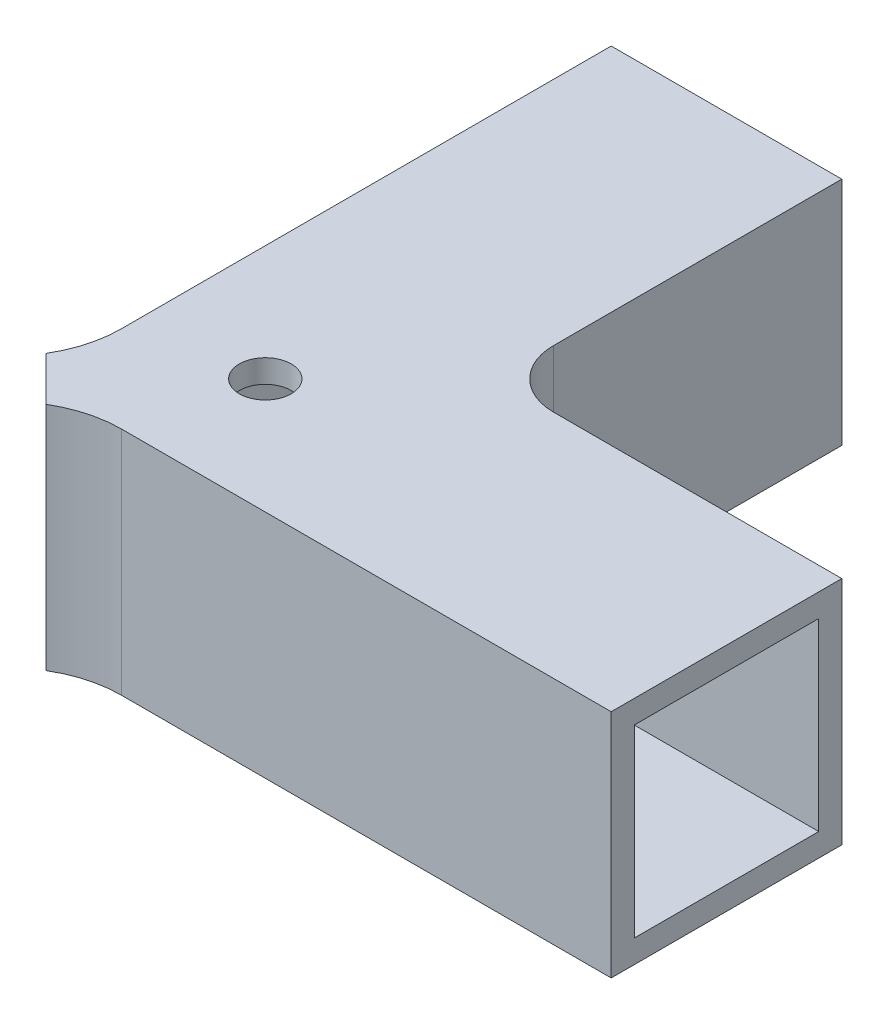
ISO-10303-21;
HEADER;
FILE_DESCRIPTION(('STEP AP214'),'2;1');
FILE_NAME('part.step','',(''),(''),'','','');
FILE_SCHEMA(('AUTOMOTIVE_DESIGN { 1 0 10303 214 1 1 1 1 }'));
ENDSEC;
DATA;
#1=APPLICATION_CONTEXT('core data for automotive mechanical design processes');
#2=APPLICATION_PROTOCOL_DEFINITION('international standard','automotive_design',2000,#1);
#3=PRODUCT_CONTEXT('',#1,'mechanical');
#4=PRODUCT('Part','Part','',(#3));
#5=PRODUCT_RELATED_PRODUCT_CATEGORY('part','',(#4));
#6=PRODUCT_DEFINITION_FORMATION('','',#4);
#7=PRODUCT_DEFINITION_CONTEXT('part definition',#1,'design');
#8=PRODUCT_DEFINITION('design','',#6,#7);
#9=PRODUCT_DEFINITION_SHAPE('','',#8);
#10=(LENGTH_UNIT() NAMED_UNIT(*) SI_UNIT(.MILLI.,.METRE.));
#11=(NAMED_UNIT(*) PLANE_ANGLE_UNIT() SI_UNIT($,.RADIAN.));
#12=(NAMED_UNIT(*) SI_UNIT($,.STERADIAN.) SOLID_ANGLE_UNIT());
#13=UNCERTAINTY_MEASURE_WITH_UNIT(LENGTH_MEASURE(1.E-05),#10,'distance_accuracy_value','');
#14=(GEOMETRIC_REPRESENTATION_CONTEXT(3) GLOBAL_UNCERTAINTY_ASSIGNED_CONTEXT((#13)) GLOBAL_UNIT_ASSIGNED_CONTEXT((#10,
#11,#12)) REPRESENTATION_CONTEXT('',''));
#15=CARTESIAN_POINT('',(0.,0.,0.));
#16=DIRECTION('',(0.,0.,1.));
#17=DIRECTION('',(1.,0.,0.));
#18=AXIS2_PLACEMENT_3D('',#15,#16,#17);
#19=CARTESIAN_POINT('',(50.,20.,50.));
#20=DIRECTION('',(0.,0.,-1.));
#21=DIRECTION('',(0.,1.,0.));
#22=AXIS2_PLACEMENT_3D('',#19,#20,#21);
#23=PLANE('',#22);
#24=DIRECTION('',(-1.,0.,0.));
#25=VECTOR('',#24,1.);
#26=CARTESIAN_POINT('',(50.,20.,50.));
#27=LINE('',#26,#25);
#28=CARTESIAN_POINT('',(50.,20.,50.));
#29=VERTEX_POINT('',#28);
#30=CARTESIAN_POINT('',(7.54103238572368,20.,50.));
#31=VERTEX_POINT('',#30);
#32=EDGE_CURVE('E248',#29,#31,#27,.T.);
#33=ORIENTED_EDGE('',*,*,#32,.T.);
#34=DIRECTION('',(0.,1.,0.));
#35=VECTOR('',#34,1.);
#36=CARTESIAN_POINT('',(7.54103238572368,20.,50.));
#37=LINE('',#36,#35);
#38=CARTESIAN_POINT('',(7.54103238572369,0.,50.));
#39=VERTEX_POINT('',#38);
#40=EDGE_CURVE('E317',#31,#39,#37,.F.);
#41=ORIENTED_EDGE('',*,*,#40,.T.);
#42=DIRECTION('',(-1.,0.,0.));
#43=VECTOR('',#42,1.);
#44=CARTESIAN_POINT('',(50.,0.,50.));
#45=LINE('',#44,#43);
#46=CARTESIAN_POINT('',(50.,0.,50.));
#47=VERTEX_POINT('',#46);
#48=EDGE_CURVE('E164',#47,#39,#45,.T.);
#49=ORIENTED_EDGE('',*,*,#48,.F.);
#50=DIRECTION('',(0.,-1.,0.));
#51=VECTOR('',#50,1.);
#52=CARTESIAN_POINT('',(50.,20.,50.));
#53=LINE('',#52,#51);
#54=EDGE_CURVE('E236',#29,#47,#53,.T.);
#55=ORIENTED_EDGE('',*,*,#54,.F.);
#56=EDGE_LOOP('',(#33,#41,#49,#55));
#57=FACE_BOUND('',#56,.T.);
#58=ADVANCED_FACE('F38',(#57),#23,.F.);
#59=CARTESIAN_POINT('',(0.,0.,30.));
#60=DIRECTION('',(1.,0.,0.));
#61=DIRECTION('',(0.,0.,-1.));
#62=AXIS2_PLACEMENT_3D('',#59,#60,#61);
#63=PLANE('',#62);
#64=DIRECTION('',(0.,0.,-1.));
#65=VECTOR('',#64,1.);
#66=CARTESIAN_POINT('',(0.,0.,30.));
#67=LINE('',#66,#65);
#68=CARTESIAN_POINT('',(0.,0.,42.4589676142763));
#69=VERTEX_POINT('',#68);
#70=CARTESIAN_POINT('',(0.,0.,0.));
#71=VERTEX_POINT('',#70);
#72=EDGE_CURVE('E310',#69,#71,#67,.T.);
#73=ORIENTED_EDGE('',*,*,#72,.F.);
#74=DIRECTION('',(0.,-1.,0.));
#75=VECTOR('',#74,1.);
#76=CARTESIAN_POINT('',(0.,0.,42.4589676142763));
#77=LINE('',#76,#75);
#78=CARTESIAN_POINT('',(0.,20.,42.4589676142763));
#79=VERTEX_POINT('',#78);
#80=EDGE_CURVE('E180',#69,#79,#77,.F.);
#81=ORIENTED_EDGE('',*,*,#80,.T.);
#82=DIRECTION('',(0.,0.,-1.));
#83=VECTOR('',#82,1.);
#84=CARTESIAN_POINT('',(0.,20.,30.));
#85=LINE('',#84,#83);
#86=CARTESIAN_POINT('',(0.,20.,0.));
#87=VERTEX_POINT('',#86);
#88=EDGE_CURVE('E301',#79,#87,#85,.T.);
#89=ORIENTED_EDGE('',*,*,#88,.T.);
#90=DIRECTION('',(0.,-1.,0.));
#91=VECTOR('',#90,1.);
#92=CARTESIAN_POINT('',(0.,0.,0.));
#93=LINE('',#92,#91);
#94=EDGE_CURVE('E285',#87,#71,#93,.T.);
#95=ORIENTED_EDGE('',*,*,#94,.T.);
#96=EDGE_LOOP('',(#73,#81,#89,#95));
#97=FACE_BOUND('',#96,.T.);
#98=ADVANCED_FACE('F374',(#97),#63,.F.);
#99=CARTESIAN_POINT('',(0.,0.,0.));
#100=DIRECTION('',(0.,0.,-1.));
#101=DIRECTION('',(-1.,0.,0.));
#102=AXIS2_PLACEMENT_3D('',#99,#100,#101);
#103=PLANE('',#102);
#104=ORIENTED_EDGE('',*,*,#94,.F.);
#105=DIRECTION('',(-1.,0.,0.));
#106=VECTOR('',#105,1.);
#107=CARTESIAN_POINT('',(0.,20.,0.));
#108=LINE('',#107,#106);
#109=CARTESIAN_POINT('',(20.,20.,0.));
#110=VERTEX_POINT('',#109);
#111=EDGE_CURVE('E297',#110,#87,#108,.T.);
#112=ORIENTED_EDGE('',*,*,#111,.F.);
#113=DIRECTION('',(0.,1.,0.));
#114=VECTOR('',#113,1.);
#115=CARTESIAN_POINT('',(20.,0.,0.));
#116=LINE('',#115,#114);
#117=CARTESIAN_POINT('',(20.,0.,0.));
#118=VERTEX_POINT('',#117);
#119=EDGE_CURVE('E293',#118,#110,#116,.T.);
#120=ORIENTED_EDGE('',*,*,#119,.F.);
#121=DIRECTION('',(1.,0.,0.));
#122=VECTOR('',#121,1.);
#123=CARTESIAN_POINT('',(0.,0.,0.));
#124=LINE('',#123,#122);
#125=EDGE_CURVE('E289',#71,#118,#124,.T.);
#126=ORIENTED_EDGE('',*,*,#125,.F.);
#127=EDGE_LOOP('',(#104,#112,#120,#126));
#128=FACE_BOUND('',#127,.T.);
#129=DIRECTION('',(-1.,0.,0.));
#130=VECTOR('',#129,1.);
#131=CARTESIAN_POINT('',(2.,18.,0.));
#132=LINE('',#131,#130);
#133=CARTESIAN_POINT('',(18.,18.,0.));
#134=VERTEX_POINT('',#133);
#135=CARTESIAN_POINT('',(2.,18.,0.));
#136=VERTEX_POINT('',#135);
#137=EDGE_CURVE('E267',#134,#136,#132,.T.);
#138=ORIENTED_EDGE('',*,*,#137,.T.);
#139=DIRECTION('',(0.,-1.,0.));
#140=VECTOR('',#139,1.);
#141=CARTESIAN_POINT('',(2.,2.,0.));
#142=LINE('',#141,#140);
#143=CARTESIAN_POINT('',(2.,2.,0.));
#144=VERTEX_POINT('',#143);
#145=EDGE_CURVE('E255',#136,#144,#142,.T.);
#146=ORIENTED_EDGE('',*,*,#145,.T.);
#147=DIRECTION('',(1.,0.,0.));
#148=VECTOR('',#147,1.);
#149=CARTESIAN_POINT('',(2.,2.,0.));
#150=LINE('',#149,#148);
#151=CARTESIAN_POINT('',(18.,2.,0.));
#152=VERTEX_POINT('',#151);
#153=EDGE_CURVE('E259',#144,#152,#150,.T.);
#154=ORIENTED_EDGE('',*,*,#153,.T.);
#155=DIRECTION('',(0.,1.,0.));
#156=VECTOR('',#155,1.);
#157=CARTESIAN_POINT('',(18.,2.,0.));
#158=LINE('',#157,#156);
#159=EDGE_CURVE('E263',#152,#134,#158,.T.);
#160=ORIENTED_EDGE('',*,*,#159,.T.);
#161=EDGE_LOOP('',(#138,#146,#154,#160));
#162=FACE_BOUND('',#161,.T.);
#163=ADVANCED_FACE('F380',(#128,#162),#103,.T.);
#164=CARTESIAN_POINT('',(0.,0.,30.));
#165=DIRECTION('',(0.,1.,0.));
#166=DIRECTION('',(0.,0.,1.));
#167=AXIS2_PLACEMENT_3D('',#164,#165,#166);
#168=PLANE('',#167);
#169=CARTESIAN_POINT('',(10.,0.,40.));
#170=DIRECTION('',(0.,1.,0.));
#171=DIRECTION('',(0.,0.,1.));
#172=AXIS2_PLACEMENT_3D('',#169,#170,#171);
#173=CIRCLE('',#172,2.25);
#174=CARTESIAN_POINT('',(10.,0.,42.25));
#175=VERTEX_POINT('',#174);
#176=EDGE_CURVE('E344',#175,#175,#173,.F.);
#177=ORIENTED_EDGE('',*,*,#176,.F.);
#178=EDGE_LOOP('',(#177));
#179=FACE_BOUND('',#178,.T.);
#180=ORIENTED_EDGE('',*,*,#48,.T.);
#181=CARTESIAN_POINT('',(7.54103238572369,0.,60.));
#182=DIRECTION('',(0.,1.,0.));
#183=DIRECTION('',(0.,0.,1.));
#184=AXIS2_PLACEMENT_3D('',#181,#182,#183);
#185=CIRCLE('',#184,10.);
#186=CARTESIAN_POINT('',(2.41421356237308,0.,51.4142135623731));
#187=VERTEX_POINT('',#186);
#188=EDGE_CURVE('E157',#39,#187,#185,.T.);
#189=ORIENTED_EDGE('',*,*,#188,.T.);
#190=DIRECTION('',(0.707106781186548,0.,0.707106781186548));
#191=VECTOR('',#190,1.);
#192=CARTESIAN_POINT('',(0.,0.,49.));
#193=LINE('',#192,#191);
#194=CARTESIAN_POINT('',(-1.41421356237311,0.,47.5857864376269));
#195=VERTEX_POINT('',#194);
#196=EDGE_CURVE('E160',#187,#195,#193,.F.);
#197=ORIENTED_EDGE('',*,*,#196,.T.);
#198=CARTESIAN_POINT('',(-9.99999999999999,0.,42.4589676142763));
#199=DIRECTION('',(0.,1.,0.));
#200=DIRECTION('',(0.,0.,1.));
#201=AXIS2_PLACEMENT_3D('',#198,#199,#200);
#202=CIRCLE('',#201,10.);
#203=EDGE_CURVE('E320',#195,#69,#202,.T.);
#204=ORIENTED_EDGE('',*,*,#203,.T.);
#205=ORIENTED_EDGE('',*,*,#72,.T.);
#206=ORIENTED_EDGE('',*,*,#125,.T.);
#207=DIRECTION('',(0.,0.,-1.));
#208=VECTOR('',#207,1.);
#209=CARTESIAN_POINT('',(20.,0.,30.));
#210=LINE('',#209,#208);
#211=CARTESIAN_POINT('',(20.,0.,25.));
#212=VERTEX_POINT('',#211);
#213=EDGE_CURVE('E307',#212,#118,#210,.T.);
#214=ORIENTED_EDGE('',*,*,#213,.F.);
#215=CARTESIAN_POINT('',(25.,0.,25.));
#216=DIRECTION('',(0.,1.,0.));
#217=DIRECTION('',(0.,0.,1.));
#218=AXIS2_PLACEMENT_3D('',#215,#216,#217);
#219=CIRCLE('',#218,5.);
#220=CARTESIAN_POINT('',(25.,0.,30.));
#221=VERTEX_POINT('',#220);
#222=EDGE_CURVE('E11',#212,#221,#219,.T.);
#223=ORIENTED_EDGE('',*,*,#222,.T.);
#224=DIRECTION('',(-1.,0.,0.));
#225=VECTOR('',#224,1.);
#226=CARTESIAN_POINT('',(50.,0.,30.));
#227=LINE('',#226,#225);
#228=CARTESIAN_POINT('',(50.,0.,30.));
#229=VERTEX_POINT('',#228);
#230=EDGE_CURVE('E242',#229,#221,#227,.T.);
#231=ORIENTED_EDGE('',*,*,#230,.F.);
#232=DIRECTION('',(0.,0.,-1.));
#233=VECTOR('',#232,1.);
#234=CARTESIAN_POINT('',(50.,0.,30.));
#235=LINE('',#234,#233);
#236=EDGE_CURVE('E239',#47,#229,#235,.T.);
#237=ORIENTED_EDGE('',*,*,#236,.F.);
#238=EDGE_LOOP('',(#180,#189,#197,#204,#205,#206,#214,#223,#231,#237));
#239=FACE_BOUND('',#238,.T.);
#240=ADVANCED_FACE('F159',(#179,#239),#168,.F.);
#241=CARTESIAN_POINT('',(20.,0.,30.));
#242=DIRECTION('',(-1.,0.,0.));
#243=DIRECTION('',(0.,0.,1.));
#244=AXIS2_PLACEMENT_3D('',#241,#242,#243);
#245=PLANE('',#244);
#246=DIRECTION('',(0.,0.,-1.));
#247=VECTOR('',#246,1.);
#248=CARTESIAN_POINT('',(20.,20.,30.));
#249=LINE('',#248,#247);
#250=CARTESIAN_POINT('',(20.,20.,25.));
#251=VERTEX_POINT('',#250);
#252=EDGE_CURVE('E304',#251,#110,#249,.T.);
#253=ORIENTED_EDGE('',*,*,#252,.F.);
#254=DIRECTION('',(0.,1.,0.));
#255=VECTOR('',#254,1.);
#256=CARTESIAN_POINT('',(20.,0.,25.));
#257=LINE('',#256,#255);
#258=EDGE_CURVE('E54',#251,#212,#257,.F.);
#259=ORIENTED_EDGE('',*,*,#258,.T.);
#260=ORIENTED_EDGE('',*,*,#213,.T.);
#261=ORIENTED_EDGE('',*,*,#119,.T.);
#262=EDGE_LOOP('',(#253,#259,#260,#261));
#263=FACE_BOUND('',#262,.T.);
#264=ADVANCED_FACE('F409',(#263),#245,.F.);
#265=CARTESIAN_POINT('',(0.,20.,30.));
#266=DIRECTION('',(0.,-1.,0.));
#267=DIRECTION('',(0.,0.,-1.));
#268=AXIS2_PLACEMENT_3D('',#265,#266,#267);
#269=PLANE('',#268);
#270=CARTESIAN_POINT('',(10.,20.,40.));
#271=DIRECTION('',(0.,1.,0.));
#272=DIRECTION('',(0.,0.,1.));
#273=AXIS2_PLACEMENT_3D('',#270,#271,#272);
#274=CIRCLE('',#273,2.25);
#275=CARTESIAN_POINT('',(10.,20.,42.25));
#276=VERTEX_POINT('',#275);
#277=EDGE_CURVE('E631',#276,#276,#274,.T.);
#278=ORIENTED_EDGE('',*,*,#277,.F.);
#279=EDGE_LOOP('',(#278));
#280=FACE_BOUND('',#279,.T.);
#281=ORIENTED_EDGE('',*,*,#88,.F.);
#282=CARTESIAN_POINT('',(-10.,20.,42.4589676142763));
#283=DIRECTION('',(0.,-1.,0.));
#284=DIRECTION('',(0.,0.,-1.));
#285=AXIS2_PLACEMENT_3D('',#282,#283,#284);
#286=CIRCLE('',#285,10.);
#287=CARTESIAN_POINT('',(-1.41421356237312,20.,47.5857864376269));
#288=VERTEX_POINT('',#287);
#289=EDGE_CURVE('E323',#79,#288,#286,.T.);
#290=ORIENTED_EDGE('',*,*,#289,.T.);
#291=DIRECTION('',(-0.707106781186548,0.,-0.707106781186548));
#292=VECTOR('',#291,1.);
#293=CARTESIAN_POINT('',(0.,20.,49.));
#294=LINE('',#293,#292);
#295=CARTESIAN_POINT('',(2.41421356237308,20.,51.4142135623731));
#296=VERTEX_POINT('',#295);
#297=EDGE_CURVE('E181',#288,#296,#294,.F.);
#298=ORIENTED_EDGE('',*,*,#297,.T.);
#299=CARTESIAN_POINT('',(7.54103238572368,20.,60.));
#300=DIRECTION('',(0.,-1.,0.));
#301=DIRECTION('',(0.,0.,-1.));
#302=AXIS2_PLACEMENT_3D('',#299,#300,#301);
#303=CIRCLE('',#302,10.);
#304=EDGE_CURVE('E170',#296,#31,#303,.T.);
#305=ORIENTED_EDGE('',*,*,#304,.T.);
#306=ORIENTED_EDGE('',*,*,#32,.F.);
#307=DIRECTION('',(0.,0.,1.));
#308=VECTOR('',#307,1.);
#309=CARTESIAN_POINT('',(50.,20.,30.));
#310=LINE('',#309,#308);
#311=CARTESIAN_POINT('',(50.,20.,30.));
#312=VERTEX_POINT('',#311);
#313=EDGE_CURVE('E233',#312,#29,#310,.T.);
#314=ORIENTED_EDGE('',*,*,#313,.F.);
#315=DIRECTION('',(-1.,0.,0.));
#316=VECTOR('',#315,1.);
#317=CARTESIAN_POINT('',(50.,20.,30.));
#318=LINE('',#317,#316);
#319=CARTESIAN_POINT('',(25.,20.,30.));
#320=VERTEX_POINT('',#319);
#321=EDGE_CURVE('E252',#312,#320,#318,.T.);
#322=ORIENTED_EDGE('',*,*,#321,.T.);
#323=CARTESIAN_POINT('',(25.,20.,25.));
#324=DIRECTION('',(0.,-1.,0.));
#325=DIRECTION('',(0.,0.,-1.));
#326=AXIS2_PLACEMENT_3D('',#323,#324,#325);
#327=CIRCLE('',#326,5.);
#328=EDGE_CURVE('E47',#320,#251,#327,.T.);
#329=ORIENTED_EDGE('',*,*,#328,.T.);
#330=ORIENTED_EDGE('',*,*,#252,.T.);
#331=ORIENTED_EDGE('',*,*,#111,.T.);
#332=EDGE_LOOP('',(#281,#290,#298,#305,#306,#314,#322,#329,#330,#331));
#333=FACE_BOUND('',#332,.T.);
#334=ADVANCED_FACE('F359',(#280,#333),#269,.F.);
#335=CARTESIAN_POINT('',(2.,2.,30.));
#336=DIRECTION('',(1.,0.,0.));
#337=DIRECTION('',(0.,0.,-1.));
#338=AXIS2_PLACEMENT_3D('',#335,#336,#337);
#339=PLANE('',#338);
#340=ORIENTED_EDGE('',*,*,#145,.F.);
#341=DIRECTION('',(0.,0.,-1.));
#342=VECTOR('',#341,1.);
#343=CARTESIAN_POINT('',(2.,18.,30.));
#344=LINE('',#343,#342);
#345=CARTESIAN_POINT('',(2.,18.,48.));
#346=VERTEX_POINT('',#345);
#347=EDGE_CURVE('E271',#346,#136,#344,.T.);
#348=ORIENTED_EDGE('',*,*,#347,.F.);
#349=DIRECTION('',(0.,1.,0.));
#350=VECTOR('',#349,1.);
#351=CARTESIAN_POINT('',(2.,18.,48.));
#352=LINE('',#351,#350);
#353=CARTESIAN_POINT('',(2.,1.99999999999999,48.));
#354=VERTEX_POINT('',#353);
#355=EDGE_CURVE('E190',#354,#346,#352,.T.);
#356=ORIENTED_EDGE('',*,*,#355,.F.);
#357=DIRECTION('',(0.,0.,-1.));
#358=VECTOR('',#357,1.);
#359=CARTESIAN_POINT('',(2.,2.,30.));
#360=LINE('',#359,#358);
#361=EDGE_CURVE('E281',#354,#144,#360,.T.);
#362=ORIENTED_EDGE('',*,*,#361,.T.);
#363=EDGE_LOOP('',(#340,#348,#356,#362));
#364=FACE_BOUND('',#363,.T.);
#365=ADVANCED_FACE('F399',(#364),#339,.T.);
#366=CARTESIAN_POINT('',(2.,2.,30.));
#367=DIRECTION('',(0.,1.,0.));
#368=DIRECTION('',(0.,0.,1.));
#369=AXIS2_PLACEMENT_3D('',#366,#367,#368);
#370=PLANE('',#369);
#371=CARTESIAN_POINT('',(10.,2.,40.));
#372=DIRECTION('',(0.,1.,0.));
#373=DIRECTION('',(0.,0.,1.));
#374=AXIS2_PLACEMENT_3D('',#371,#372,#373);
#375=CIRCLE('',#374,2.25);
#376=CARTESIAN_POINT('',(10.,2.,42.25));
#377=VERTEX_POINT('',#376);
#378=EDGE_CURVE('E186',#377,#377,#375,.T.);
#379=ORIENTED_EDGE('',*,*,#378,.F.);
#380=EDGE_LOOP('',(#379));
#381=FACE_BOUND('',#380,.T.);
#382=ORIENTED_EDGE('',*,*,#361,.F.);
#383=DIRECTION('',(-1.,0.,0.));
#384=VECTOR('',#383,1.);
#385=CARTESIAN_POINT('',(50.,1.99999999999999,48.));
#386=LINE('',#385,#384);
#387=CARTESIAN_POINT('',(50.,1.99999999999999,48.));
#388=VERTEX_POINT('',#387);
#389=EDGE_CURVE('E221',#388,#354,#386,.T.);
#390=ORIENTED_EDGE('',*,*,#389,.F.);
#391=DIRECTION('',(0.,0.,-1.));
#392=VECTOR('',#391,1.);
#393=CARTESIAN_POINT('',(50.,2.,32.));
#394=LINE('',#393,#392);
#395=CARTESIAN_POINT('',(50.,2.,32.));
#396=VERTEX_POINT('',#395);
#397=EDGE_CURVE('E206',#388,#396,#394,.T.);
#398=ORIENTED_EDGE('',*,*,#397,.T.);
#399=DIRECTION('',(-1.,0.,0.));
#400=VECTOR('',#399,1.);
#401=CARTESIAN_POINT('',(50.,2.,32.));
#402=LINE('',#401,#400);
#403=CARTESIAN_POINT('',(21.,2.,32.));
#404=VERTEX_POINT('',#403);
#405=EDGE_CURVE('E217',#396,#404,#402,.T.);
#406=ORIENTED_EDGE('',*,*,#405,.T.);
#407=CARTESIAN_POINT('',(21.,2.,29.));
#408=DIRECTION('',(0.,1.,0.));
#409=DIRECTION('',(0.,0.,1.));
#410=AXIS2_PLACEMENT_3D('',#407,#408,#409);
#411=CIRCLE('',#410,3.);
#412=CARTESIAN_POINT('',(18.,2.,29.));
#413=VERTEX_POINT('',#412);
#414=EDGE_CURVE('E334',#404,#413,#411,.F.);
#415=ORIENTED_EDGE('',*,*,#414,.T.);
#416=DIRECTION('',(0.,0.,-1.));
#417=VECTOR('',#416,1.);
#418=CARTESIAN_POINT('',(18.,2.,30.));
#419=LINE('',#418,#417);
#420=EDGE_CURVE('E278',#413,#152,#419,.T.);
#421=ORIENTED_EDGE('',*,*,#420,.T.);
#422=ORIENTED_EDGE('',*,*,#153,.F.);
#423=EDGE_LOOP('',(#382,#390,#398,#406,#415,#421,#422));
#424=FACE_BOUND('',#423,.T.);
#425=ADVANCED_FACE('F395',(#381,#424),#370,.T.);
#426=CARTESIAN_POINT('',(18.,2.,30.));
#427=DIRECTION('',(-1.,0.,0.));
#428=DIRECTION('',(0.,0.,1.));
#429=AXIS2_PLACEMENT_3D('',#426,#427,#428);
#430=PLANE('',#429);
#431=ORIENTED_EDGE('',*,*,#420,.F.);
#432=DIRECTION('',(0.,-1.,0.));
#433=VECTOR('',#432,1.);
#434=CARTESIAN_POINT('',(18.,2.,29.));
#435=LINE('',#434,#433);
#436=CARTESIAN_POINT('',(18.,18.,29.));
#437=VERTEX_POINT('',#436);
#438=EDGE_CURVE('E331',#413,#437,#435,.F.);
#439=ORIENTED_EDGE('',*,*,#438,.T.);
#440=DIRECTION('',(0.,0.,-1.));
#441=VECTOR('',#440,1.);
#442=CARTESIAN_POINT('',(18.,18.,30.));
#443=LINE('',#442,#441);
#444=EDGE_CURVE('E275',#437,#134,#443,.T.);
#445=ORIENTED_EDGE('',*,*,#444,.T.);
#446=ORIENTED_EDGE('',*,*,#159,.F.);
#447=EDGE_LOOP('',(#431,#439,#445,#446));
#448=FACE_BOUND('',#447,.T.);
#449=ADVANCED_FACE('F391',(#448),#430,.T.);
#450=CARTESIAN_POINT('',(2.,18.,30.));
#451=DIRECTION('',(0.,-1.,0.));
#452=DIRECTION('',(0.,0.,-1.));
#453=AXIS2_PLACEMENT_3D('',#450,#451,#452);
#454=PLANE('',#453);
#455=CARTESIAN_POINT('',(10.,18.,40.));
#456=DIRECTION('',(0.,-1.,0.));
#457=DIRECTION('',(0.,0.,-1.));
#458=AXIS2_PLACEMENT_3D('',#455,#456,#457);
#459=CIRCLE('',#458,2.25);
#460=CARTESIAN_POINT('',(10.,18.,37.75));
#461=VERTEX_POINT('',#460);
#462=EDGE_CURVE('E193',#461,#461,#459,.T.);
#463=ORIENTED_EDGE('',*,*,#462,.F.);
#464=EDGE_LOOP('',(#463));
#465=FACE_BOUND('',#464,.T.);
#466=DIRECTION('',(-1.,0.,0.));
#467=VECTOR('',#466,1.);
#468=CARTESIAN_POINT('',(50.,18.,48.));
#469=LINE('',#468,#467);
#470=CARTESIAN_POINT('',(50.,18.,48.));
#471=VERTEX_POINT('',#470);
#472=EDGE_CURVE('E225',#471,#346,#469,.T.);
#473=ORIENTED_EDGE('',*,*,#472,.T.);
#474=ORIENTED_EDGE('',*,*,#347,.T.);
#475=ORIENTED_EDGE('',*,*,#137,.F.);
#476=ORIENTED_EDGE('',*,*,#444,.F.);
#477=CARTESIAN_POINT('',(21.,18.,29.));
#478=DIRECTION('',(0.,-1.,0.));
#479=DIRECTION('',(0.,0.,-1.));
#480=AXIS2_PLACEMENT_3D('',#477,#478,#479);
#481=CIRCLE('',#480,3.);
#482=CARTESIAN_POINT('',(21.,18.,32.));
#483=VERTEX_POINT('',#482);
#484=EDGE_CURVE('E337',#437,#483,#481,.F.);
#485=ORIENTED_EDGE('',*,*,#484,.T.);
#486=DIRECTION('',(-1.,0.,0.));
#487=VECTOR('',#486,1.);
#488=CARTESIAN_POINT('',(50.,18.,32.));
#489=LINE('',#488,#487);
#490=CARTESIAN_POINT('',(50.,18.,32.));
#491=VERTEX_POINT('',#490);
#492=EDGE_CURVE('E213',#491,#483,#489,.T.);
#493=ORIENTED_EDGE('',*,*,#492,.F.);
#494=DIRECTION('',(0.,0.,1.));
#495=VECTOR('',#494,1.);
#496=CARTESIAN_POINT('',(50.,18.,32.));
#497=LINE('',#496,#495);
#498=EDGE_CURVE('E200',#491,#471,#497,.T.);
#499=ORIENTED_EDGE('',*,*,#498,.T.);
#500=EDGE_LOOP('',(#473,#474,#475,#476,#485,#493,#499));
#501=FACE_BOUND('',#500,.T.);
#502=ADVANCED_FACE('F388',(#465,#501),#454,.T.);
#503=CARTESIAN_POINT('',(50.,20.,30.));
#504=DIRECTION('',(0.,0.,1.));
#505=DIRECTION('',(1.,0.,0.));
#506=AXIS2_PLACEMENT_3D('',#503,#504,#505);
#507=PLANE('',#506);
#508=ORIENTED_EDGE('',*,*,#230,.T.);
#509=DIRECTION('',(0.,1.,0.));
#510=VECTOR('',#509,1.);
#511=CARTESIAN_POINT('',(25.,20.,30.));
#512=LINE('',#511,#510);
#513=EDGE_CURVE('E340',#221,#320,#512,.T.);
#514=ORIENTED_EDGE('',*,*,#513,.T.);
#515=ORIENTED_EDGE('',*,*,#321,.F.);
#516=DIRECTION('',(0.,1.,0.));
#517=VECTOR('',#516,1.);
#518=CARTESIAN_POINT('',(50.,20.,30.));
#519=LINE('',#518,#517);
#520=EDGE_CURVE('E229',#229,#312,#519,.T.);
#521=ORIENTED_EDGE('',*,*,#520,.F.);
#522=EDGE_LOOP('',(#508,#514,#515,#521));
#523=FACE_BOUND('',#522,.T.);
#524=ADVANCED_FACE('F353',(#523),#507,.F.);
#525=CARTESIAN_POINT('',(50.,0.,0.));
#526=DIRECTION('',(-1.,0.,0.));
#527=DIRECTION('',(0.,0.,1.));
#528=AXIS2_PLACEMENT_3D('',#525,#526,#527);
#529=PLANE('',#528);
#530=ORIENTED_EDGE('',*,*,#520,.T.);
#531=ORIENTED_EDGE('',*,*,#313,.T.);
#532=ORIENTED_EDGE('',*,*,#54,.T.);
#533=ORIENTED_EDGE('',*,*,#236,.T.);
#534=EDGE_LOOP('',(#530,#531,#532,#533));
#535=FACE_BOUND('',#534,.T.);
#536=ORIENTED_EDGE('',*,*,#498,.F.);
#537=DIRECTION('',(0.,1.,0.));
#538=VECTOR('',#537,1.);
#539=CARTESIAN_POINT('',(50.,18.,32.));
#540=LINE('',#539,#538);
#541=EDGE_CURVE('E210',#396,#491,#540,.T.);
#542=ORIENTED_EDGE('',*,*,#541,.F.);
#543=ORIENTED_EDGE('',*,*,#397,.F.);
#544=DIRECTION('',(0.,-1.,0.));
#545=VECTOR('',#544,1.);
#546=CARTESIAN_POINT('',(50.,18.,48.));
#547=LINE('',#546,#545);
#548=EDGE_CURVE('E203',#471,#388,#547,.T.);
#549=ORIENTED_EDGE('',*,*,#548,.F.);
#550=EDGE_LOOP('',(#536,#542,#543,#549));
#551=FACE_BOUND('',#550,.T.);
#552=ADVANCED_FACE('F363',(#535,#551),#529,.F.);
#553=CARTESIAN_POINT('',(50.,18.,48.));
#554=DIRECTION('',(0.,0.,-1.));
#555=DIRECTION('',(-1.,0.,0.));
#556=AXIS2_PLACEMENT_3D('',#553,#554,#555);
#557=PLANE('',#556);
#558=ORIENTED_EDGE('',*,*,#355,.T.);
#559=ORIENTED_EDGE('',*,*,#472,.F.);
#560=ORIENTED_EDGE('',*,*,#548,.T.);
#561=ORIENTED_EDGE('',*,*,#389,.T.);
#562=EDGE_LOOP('',(#558,#559,#560,#561));
#563=FACE_BOUND('',#562,.T.);
#564=ADVANCED_FACE('F445',(#563),#557,.T.);
#565=CARTESIAN_POINT('',(50.,18.,32.));
#566=DIRECTION('',(0.,0.,1.));
#567=DIRECTION('',(1.,0.,0.));
#568=AXIS2_PLACEMENT_3D('',#565,#566,#567);
#569=PLANE('',#568);
#570=ORIENTED_EDGE('',*,*,#492,.T.);
#571=DIRECTION('',(0.,-1.,0.));
#572=VECTOR('',#571,1.);
#573=CARTESIAN_POINT('',(21.,18.,32.));
#574=LINE('',#573,#572);
#575=EDGE_CURVE('E169',#483,#404,#574,.T.);
#576=ORIENTED_EDGE('',*,*,#575,.T.);
#577=ORIENTED_EDGE('',*,*,#405,.F.);
#578=ORIENTED_EDGE('',*,*,#541,.T.);
#579=EDGE_LOOP('',(#570,#576,#577,#578));
#580=FACE_BOUND('',#579,.T.);
#581=ADVANCED_FACE('F419',(#580),#569,.T.);
#582=CARTESIAN_POINT('',(0.,0.,49.));
#583=DIRECTION('',(0.707106781186547,0.,-0.707106781186547));
#584=DIRECTION('',(0.,1.,0.));
#585=AXIS2_PLACEMENT_3D('',#582,#583,#584);
#586=PLANE('',#585);
#587=ORIENTED_EDGE('',*,*,#196,.F.);
#588=DIRECTION('',(0.,1.,0.));
#589=VECTOR('',#588,1.);
#590=CARTESIAN_POINT('',(2.41421356237308,0.,51.4142135623731));
#591=LINE('',#590,#589);
#592=EDGE_CURVE('E176',#187,#296,#591,.T.);
#593=ORIENTED_EDGE('',*,*,#592,.T.);
#594=ORIENTED_EDGE('',*,*,#297,.F.);
#595=DIRECTION('',(0.,-1.,0.));
#596=VECTOR('',#595,1.);
#597=CARTESIAN_POINT('',(-1.41421356237312,20.,47.5857864376269));
#598=LINE('',#597,#596);
#599=EDGE_CURVE('E178',#288,#195,#598,.T.);
#600=ORIENTED_EDGE('',*,*,#599,.T.);
#601=EDGE_LOOP('',(#587,#593,#594,#600));
#602=FACE_BOUND('',#601,.T.);
#603=ADVANCED_FACE('F174',(#602),#586,.F.);
#604=CARTESIAN_POINT('',(-10.,20.,42.4589676142763));
#605=DIRECTION('',(0.,-1.,0.));
#606=DIRECTION('',(1.,0.,0.));
#607=AXIS2_PLACEMENT_3D('',#604,#605,#606);
#608=CYLINDRICAL_SURFACE('',#607,10.);
#609=ORIENTED_EDGE('',*,*,#289,.F.);
#610=ORIENTED_EDGE('',*,*,#80,.F.);
#611=ORIENTED_EDGE('',*,*,#203,.F.);
#612=ORIENTED_EDGE('',*,*,#599,.F.);
#613=EDGE_LOOP('',(#609,#610,#611,#612));
#614=FACE_BOUND('',#613,.T.);
#615=ADVANCED_FACE('F418',(#614),#608,.F.);
#616=CARTESIAN_POINT('',(7.54103238572369,0.,60.));
#617=DIRECTION('',(0.,1.,0.));
#618=DIRECTION('',(-1.,0.,0.));
#619=AXIS2_PLACEMENT_3D('',#616,#617,#618);
#620=CYLINDRICAL_SURFACE('',#619,10.);
#621=ORIENTED_EDGE('',*,*,#188,.F.);
#622=ORIENTED_EDGE('',*,*,#40,.F.);
#623=ORIENTED_EDGE('',*,*,#304,.F.);
#624=ORIENTED_EDGE('',*,*,#592,.F.);
#625=EDGE_LOOP('',(#621,#622,#623,#624));
#626=FACE_BOUND('',#625,.T.);
#627=ADVANCED_FACE('F183',(#626),#620,.F.);
#628=CARTESIAN_POINT('',(21.,18.,29.));
#629=DIRECTION('',(0.,-1.,0.));
#630=DIRECTION('',(0.,0.,-1.));
#631=AXIS2_PLACEMENT_3D('',#628,#629,#630);
#632=CYLINDRICAL_SURFACE('',#631,3.);
#633=ORIENTED_EDGE('',*,*,#484,.F.);
#634=ORIENTED_EDGE('',*,*,#438,.F.);
#635=ORIENTED_EDGE('',*,*,#414,.F.);
#636=ORIENTED_EDGE('',*,*,#575,.F.);
#637=EDGE_LOOP('',(#633,#634,#635,#636));
#638=FACE_BOUND('',#637,.T.);
#639=ADVANCED_FACE('F424',(#638),#632,.T.);
#640=CARTESIAN_POINT('',(10.,-6.36396103067892,40.));
#641=DIRECTION('',(0.,1.,0.));
#642=DIRECTION('',(0.,0.,1.));
#643=AXIS2_PLACEMENT_3D('',#640,#641,#642);
#644=CYLINDRICAL_SURFACE('',#643,2.25);
#645=ORIENTED_EDGE('',*,*,#462,.T.);
#646=EDGE_LOOP('',(#645));
#647=FACE_BOUND('',#646,.T.);
#648=ORIENTED_EDGE('',*,*,#277,.T.);
#649=EDGE_LOOP('',(#648));
#650=FACE_BOUND('',#649,.T.);
#651=ADVANCED_FACE('F370',(#647,#650),#644,.F.);
#652=ORIENTED_EDGE('',*,*,#378,.T.);
#653=EDGE_LOOP('',(#652));
#654=FACE_BOUND('',#653,.T.);
#655=ORIENTED_EDGE('',*,*,#176,.T.);
#656=EDGE_LOOP('',(#655));
#657=FACE_BOUND('',#656,.T.);
#658=ADVANCED_FACE('F366',(#654,#657),#644,.F.);
#659=CARTESIAN_POINT('',(25.,20.,25.));
#660=DIRECTION('',(0.,-1.,0.));
#661=DIRECTION('',(0.,0.,-1.));
#662=AXIS2_PLACEMENT_3D('',#659,#660,#661);
#663=CYLINDRICAL_SURFACE('',#662,5.);
#664=ORIENTED_EDGE('',*,*,#222,.F.);
#665=ORIENTED_EDGE('',*,*,#258,.F.);
#666=ORIENTED_EDGE('',*,*,#328,.F.);
#667=ORIENTED_EDGE('',*,*,#513,.F.);
#668=EDGE_LOOP('',(#664,#665,#666,#667));
#669=FACE_BOUND('',#668,.T.);
#670=ADVANCED_FACE('F40',(#669),#663,.F.);
#671=CLOSED_SHELL('',(#58,#98,#163,#240,#264,#334,#365,#425,#449,#502,#524,#552,#564,#581,#603,
#615,#627,#639,#651,#658,#670));
#672=MANIFOLD_SOLID_BREP('B2',#671);
#673=ADVANCED_BREP_SHAPE_REPRESENTATION('',(#18,#672),#14);
#674=SHAPE_DEFINITION_REPRESENTATION(#9,#673);
ENDSEC;
END-ISO-10303-21;
